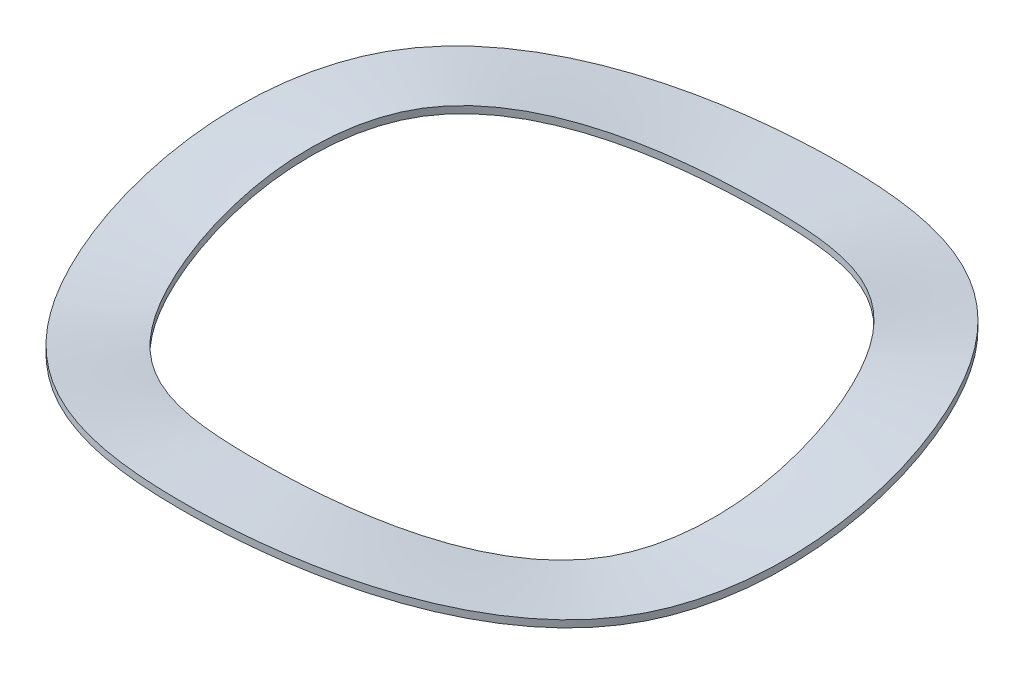
ISO-10303-21;
HEADER;
FILE_DESCRIPTION(('STEP AP214'),'2;1');
FILE_NAME('part.step','',(''),(''),'','','');
FILE_SCHEMA(('AUTOMOTIVE_DESIGN { 1 0 10303 214 1 1 1 1 }'));
ENDSEC;
DATA;
#1=APPLICATION_CONTEXT('core data for automotive mechanical design processes');
#2=APPLICATION_PROTOCOL_DEFINITION('international standard','automotive_design',2000,#1);
#3=PRODUCT_CONTEXT('',#1,'mechanical');
#4=PRODUCT('Part','Part','',(#3));
#5=PRODUCT_RELATED_PRODUCT_CATEGORY('part','',(#4));
#6=PRODUCT_DEFINITION_FORMATION('','',#4);
#7=PRODUCT_DEFINITION_CONTEXT('part definition',#1,'design');
#8=PRODUCT_DEFINITION('design','',#6,#7);
#9=PRODUCT_DEFINITION_SHAPE('','',#8);
#10=(LENGTH_UNIT() NAMED_UNIT(*) SI_UNIT(.MILLI.,.METRE.));
#11=(NAMED_UNIT(*) PLANE_ANGLE_UNIT() SI_UNIT($,.RADIAN.));
#12=(NAMED_UNIT(*) SI_UNIT($,.STERADIAN.) SOLID_ANGLE_UNIT());
#13=UNCERTAINTY_MEASURE_WITH_UNIT(LENGTH_MEASURE(1.E-05),#10,'distance_accuracy_value','');
#14=(GEOMETRIC_REPRESENTATION_CONTEXT(3) GLOBAL_UNCERTAINTY_ASSIGNED_CONTEXT((#13)) GLOBAL_UNIT_ASSIGNED_CONTEXT((#10,
#11,#12)) REPRESENTATION_CONTEXT('',''));
#15=CARTESIAN_POINT('',(0.,0.,0.));
#16=DIRECTION('',(0.,0.,1.));
#17=DIRECTION('',(1.,0.,0.));
#18=AXIS2_PLACEMENT_3D('',#15,#16,#17);
#19=CARTESIAN_POINT('',(0.,0.,-10.6553));
#20=CARTESIAN_POINT('',(3.69110419397773,0.,-10.6553));
#21=CARTESIAN_POINT('',(11.0733125819332,3.1242,-6.39318));
#22=CARTESIAN_POINT('',(11.0733125819332,-1.5621,6.39318000000003));
#23=CARTESIAN_POINT('',(0.,3.12419999999999,12.78636));
#24=CARTESIAN_POINT('',(-11.0733125819332,-1.5621,6.39317999999996));
#25=CARTESIAN_POINT('',(-11.0733125819332,1.5621,-2.13106000000005));
#26=CARTESIAN_POINT('',(-7.38220838795543,1.5621,-8.52424000000004));
#27=CARTESIAN_POINT('',(-3.69110419397772,0.,-10.6553));
#28=CARTESIAN_POINT('',(0.,0.,-10.6553));
#29=CARTESIAN_POINT('',(0.,0.,-11.6755333333333));
#30=CARTESIAN_POINT('',(4.04452338775946,0.,-11.6755333333333));
#31=CARTESIAN_POINT('',(12.1335701632784,3.1242,-7.00532));
#32=CARTESIAN_POINT('',(12.1335701632784,-1.5621,7.00532000000003));
#33=CARTESIAN_POINT('',(0.,3.1242,14.01064));
#34=CARTESIAN_POINT('',(-12.1335701632785,-1.5621,7.00531999999996));
#35=CARTESIAN_POINT('',(-12.1335701632784,1.5621,-2.33510666666672));
#36=CARTESIAN_POINT('',(-8.08904677551891,1.5621,-9.34042666666671));
#37=CARTESIAN_POINT('',(-4.04452338775946,0.,-11.6755333333333));
#38=CARTESIAN_POINT('',(0.,0.,-11.6755333333333));
#39=CARTESIAN_POINT('',(0.,0.,-12.6957666666667));
#40=CARTESIAN_POINT('',(4.3979425815412,0.,-12.6957666666667));
#41=CARTESIAN_POINT('',(13.1938277446236,3.1242,-7.61746));
#42=CARTESIAN_POINT('',(13.1938277446236,-1.5621,7.61746000000003));
#43=CARTESIAN_POINT('',(0.,3.1242,15.23492));
#44=CARTESIAN_POINT('',(-13.1938277446237,-1.5621,7.61745999999995));
#45=CARTESIAN_POINT('',(-13.1938277446236,1.5621,-2.53915333333339));
#46=CARTESIAN_POINT('',(-8.79588516308238,1.5621,-10.1566133333334));
#47=CARTESIAN_POINT('',(-4.3979425815412,0.,-12.6957666666667));
#48=CARTESIAN_POINT('',(0.,0.,-12.6957666666667));
#49=CARTESIAN_POINT('',(0.,0.,-13.716));
#50=CARTESIAN_POINT('',(4.75136177532294,0.,-13.716));
#51=CARTESIAN_POINT('',(14.2540853259689,3.1242,-8.2296));
#52=CARTESIAN_POINT('',(14.2540853259688,-1.5621,8.22960000000003));
#53=CARTESIAN_POINT('',(0.,3.1242,16.4592));
#54=CARTESIAN_POINT('',(-14.2540853259689,-1.5621,8.22959999999994));
#55=CARTESIAN_POINT('',(-14.2540853259688,1.5621,-2.74320000000006));
#56=CARTESIAN_POINT('',(-9.50272355064585,1.5621,-10.9728));
#57=CARTESIAN_POINT('',(-4.75136177532293,0.,-13.716));
#58=CARTESIAN_POINT('',(0.,0.,-13.716));
#59=B_SPLINE_SURFACE_WITH_KNOTS('',3,3,((#19,#20,#21,#22,#23,#24,#25,#26,#27,#28),(#29,#30,#31,
#32,#33,#34,#35,#36,#37,#38),(#39,#40,#41,#42,#43,#44,#45,#46,#47,#48),(#49,#50,#51,#52,#53,#54,
#55,#56,#57,#58)),.UNSPECIFIED.,.F.,.T.,.F.,(4,4),(4,1,1,1,1,2,4),(0.,1.),(0.,0.166666666666667,
0.333333333333334,0.5,0.666666666666666,0.833333333333333,1.),.UNSPECIFIED.);
#60=CARTESIAN_POINT('',(0.,0.,-13.716));
#61=CARTESIAN_POINT('',(4.75136177532294,0.,-13.716));
#62=CARTESIAN_POINT('',(14.2540853259689,3.1242,-8.2296));
#63=CARTESIAN_POINT('',(14.2540853259688,-1.5621,8.22960000000003));
#64=CARTESIAN_POINT('',(0.,3.1242,16.4592));
#65=CARTESIAN_POINT('',(-14.2540853259689,-1.5621,8.22959999999994));
#66=CARTESIAN_POINT('',(-14.2540853259688,1.5621,-2.74320000000006));
#67=CARTESIAN_POINT('',(-9.50272355064585,1.5621,-10.9728));
#68=CARTESIAN_POINT('',(-4.75136177532293,0.,-13.716));
#69=CARTESIAN_POINT('',(0.,0.,-13.716));
#70=B_SPLINE_CURVE_WITH_KNOTS('',3,(#60,#61,#62,#63,#64,#65,#66,#67,#68,#69),.UNSPECIFIED.,.T.,
.F.,(4,1,1,1,1,2,4),(0.,0.166666666666667,0.333333333333334,0.5,0.666666666666666,
0.833333333333333,1.),.UNSPECIFIED.);
#71=CARTESIAN_POINT('',(0.,0.,-13.716));
#72=VERTEX_POINT('',#71);
#73=EDGE_CURVE('E20',#72,#72,#70,.F.);
#74=CARTESIAN_POINT('',(0.,0.,-10.6553));
#75=CARTESIAN_POINT('',(3.69110419397773,0.,-10.6553));
#76=CARTESIAN_POINT('',(11.0733125819332,3.1242,-6.39318));
#77=CARTESIAN_POINT('',(11.0733125819332,-1.5621,6.39318000000003));
#78=CARTESIAN_POINT('',(0.,3.12419999999999,12.78636));
#79=CARTESIAN_POINT('',(-11.0733125819332,-1.5621,6.39317999999996));
#80=CARTESIAN_POINT('',(-11.0733125819332,1.5621,-2.13106000000005));
#81=CARTESIAN_POINT('',(-7.38220838795543,1.5621,-8.52424000000004));
#82=CARTESIAN_POINT('',(-3.69110419397772,0.,-10.6553));
#83=CARTESIAN_POINT('',(0.,0.,-10.6553));
#84=B_SPLINE_CURVE_WITH_KNOTS('',3,(#74,#75,#76,#77,#78,#79,#80,#81,#82,#83),.UNSPECIFIED.,.T.,
.F.,(4,1,1,1,1,2,4),(0.,0.166666666666667,0.333333333333334,0.5,0.666666666666666,
0.833333333333333,1.),.UNSPECIFIED.);
#85=CARTESIAN_POINT('',(0.,0.,-10.6553));
#86=VERTEX_POINT('',#85);
#87=EDGE_CURVE('E31',#86,#86,#84,.T.);
#88=ORIENTED_EDGE('',*,*,#73,.F.);
#89=EDGE_LOOP('',(#88));
#90=FACE_BOUND('',#89,.T.);
#91=ORIENTED_EDGE('',*,*,#87,.F.);
#92=EDGE_LOOP('',(#91));
#93=FACE_BOUND('',#92,.T.);
#94=ADVANCED_FACE('F14',(#90,#93),#59,.T.);
#95=CARTESIAN_POINT('',(0.,0.,-13.716));
#96=CARTESIAN_POINT('',(4.75136177532294,0.,-13.716));
#97=CARTESIAN_POINT('',(14.2540853259689,3.1242,-8.2296));
#98=CARTESIAN_POINT('',(14.2540853259688,-1.5621,8.22960000000003));
#99=CARTESIAN_POINT('',(0.,3.1242,16.4592));
#100=CARTESIAN_POINT('',(-14.2540853259689,-1.5621,8.22959999999994));
#101=CARTESIAN_POINT('',(-14.2540853259688,1.5621,-2.74320000000006));
#102=CARTESIAN_POINT('',(-9.50272355064585,1.5621,-10.9728));
#103=CARTESIAN_POINT('',(-4.75136177532293,0.,-13.716));
#104=CARTESIAN_POINT('',(0.,0.,-13.716));
#105=CARTESIAN_POINT('',(0.,0.0973666666666665,-13.716));
#106=CARTESIAN_POINT('',(4.75136177532294,0.0973666666666662,-13.716));
#107=CARTESIAN_POINT('',(14.2540853259689,3.22156666666667,-8.2296));
#108=CARTESIAN_POINT('',(14.2540853259688,-1.46473333333333,8.22960000000003));
#109=CARTESIAN_POINT('',(0.,3.22156666666666,16.4592));
#110=CARTESIAN_POINT('',(-14.2540853259689,-1.46473333333333,8.22959999999994));
#111=CARTESIAN_POINT('',(-14.2540853259688,1.65946666666666,-2.74320000000006));
#112=CARTESIAN_POINT('',(-9.50272355064585,1.65946666666667,-10.9728));
#113=CARTESIAN_POINT('',(-4.75136177532293,0.0973666666666667,-13.716));
#114=CARTESIAN_POINT('',(0.,0.0973666666666665,-13.716));
#115=CARTESIAN_POINT('',(0.,0.194733333333333,-13.716));
#116=CARTESIAN_POINT('',(4.75136177532294,0.194733333333333,-13.716));
#117=CARTESIAN_POINT('',(14.2540853259689,3.31893333333333,-8.2296));
#118=CARTESIAN_POINT('',(14.2540853259688,-1.36736666666666,8.22960000000003));
#119=CARTESIAN_POINT('',(0.,3.31893333333333,16.4592));
#120=CARTESIAN_POINT('',(-14.2540853259689,-1.36736666666667,8.22959999999994));
#121=CARTESIAN_POINT('',(-14.2540853259688,1.75683333333333,-2.74320000000006));
#122=CARTESIAN_POINT('',(-9.50272355064585,1.75683333333334,-10.9728));
#123=CARTESIAN_POINT('',(-4.75136177532293,0.194733333333333,-13.716));
#124=CARTESIAN_POINT('',(0.,0.194733333333333,-13.716));
#125=CARTESIAN_POINT('',(0.,0.292099999999999,-13.716));
#126=CARTESIAN_POINT('',(4.75136177532294,0.292099999999999,-13.716));
#127=CARTESIAN_POINT('',(14.2540853259689,3.4163,-8.2296));
#128=CARTESIAN_POINT('',(14.2540853259688,-1.27,8.22960000000003));
#129=CARTESIAN_POINT('',(0.,3.4163,16.4592));
#130=CARTESIAN_POINT('',(-14.2540853259689,-1.27,8.22959999999994));
#131=CARTESIAN_POINT('',(-14.2540853259688,1.8542,-2.74320000000006));
#132=CARTESIAN_POINT('',(-9.50272355064585,1.8542,-10.9728));
#133=CARTESIAN_POINT('',(-4.75136177532293,0.2921,-13.716));
#134=CARTESIAN_POINT('',(0.,0.292099999999999,-13.716));
#135=B_SPLINE_SURFACE_WITH_KNOTS('',3,3,((#95,#96,#97,#98,#99,#100,#101,#102,#103,#104),(#105,
#106,#107,#108,#109,#110,#111,#112,#113,#114),(#115,#116,#117,#118,#119,#120,#121,#122,#123,
#124),(#125,#126,#127,#128,#129,#130,#131,#132,#133,#134)),.UNSPECIFIED.,.F.,.T.,.F.,(4,4),(4,1,
1,1,1,2,4),(0.,1.),(0.,0.166666666666667,0.333333333333334,0.5,0.666666666666666,
0.833333333333333,1.),.UNSPECIFIED.);
#136=CARTESIAN_POINT('',(0.,0.292099999999999,-13.716));
#137=CARTESIAN_POINT('',(4.75136177532294,0.292099999999999,-13.716));
#138=CARTESIAN_POINT('',(14.2540853259689,3.4163,-8.2296));
#139=CARTESIAN_POINT('',(14.2540853259688,-1.27,8.22960000000003));
#140=CARTESIAN_POINT('',(0.,3.4163,16.4592));
#141=CARTESIAN_POINT('',(-14.2540853259689,-1.27,8.22959999999994));
#142=CARTESIAN_POINT('',(-14.2540853259688,1.8542,-2.74320000000006));
#143=CARTESIAN_POINT('',(-9.50272355064585,1.8542,-10.9728));
#144=CARTESIAN_POINT('',(-4.75136177532293,0.2921,-13.716));
#145=CARTESIAN_POINT('',(0.,0.292099999999999,-13.716));
#146=B_SPLINE_CURVE_WITH_KNOTS('',3,(#136,#137,#138,#139,#140,#141,#142,#143,#144,#145),
.UNSPECIFIED.,.T.,.F.,(4,1,1,1,1,2,4),(0.,0.166666666666667,0.333333333333334,0.5,
0.666666666666666,0.833333333333333,1.),.UNSPECIFIED.);
#147=CARTESIAN_POINT('',(0.,0.292099999999999,-13.716));
#148=VERTEX_POINT('',#147);
#149=EDGE_CURVE('E26',#148,#148,#146,.F.);
#150=ORIENTED_EDGE('',*,*,#149,.F.);
#151=EDGE_LOOP('',(#150));
#152=FACE_BOUND('',#151,.T.);
#153=ORIENTED_EDGE('',*,*,#73,.T.);
#154=EDGE_LOOP('',(#153));
#155=FACE_BOUND('',#154,.T.);
#156=ADVANCED_FACE('F54',(#152,#155),#135,.T.);
#157=CARTESIAN_POINT('',(0.,0.292099999999999,-10.6553));
#158=CARTESIAN_POINT('',(3.69110419397773,0.292099999999999,-10.6553));
#159=CARTESIAN_POINT('',(11.0733125819332,3.4163,-6.39318));
#160=CARTESIAN_POINT('',(11.0733125819332,-1.27,6.39318000000003));
#161=CARTESIAN_POINT('',(0.,3.4163,12.78636));
#162=CARTESIAN_POINT('',(-11.0733125819332,-1.27000000000001,6.39317999999996));
#163=CARTESIAN_POINT('',(-11.0733125819332,1.8542,-2.13106000000005));
#164=CARTESIAN_POINT('',(-7.38220838795543,1.8542,-8.52424000000004));
#165=CARTESIAN_POINT('',(-3.69110419397772,0.2921,-10.6553));
#166=CARTESIAN_POINT('',(0.,0.292099999999999,-10.6553));
#167=CARTESIAN_POINT('',(0.,0.194733333333333,-10.6553));
#168=CARTESIAN_POINT('',(3.69110419397773,0.194733333333332,-10.6553));
#169=CARTESIAN_POINT('',(11.0733125819332,3.31893333333334,-6.39318));
#170=CARTESIAN_POINT('',(11.0733125819332,-1.36736666666667,6.39318000000003));
#171=CARTESIAN_POINT('',(0.,3.31893333333333,12.78636));
#172=CARTESIAN_POINT('',(-11.0733125819332,-1.36736666666667,6.39317999999996));
#173=CARTESIAN_POINT('',(-11.0733125819332,1.75683333333333,-2.13106000000005));
#174=CARTESIAN_POINT('',(-7.38220838795543,1.75683333333334,-8.52424000000004));
#175=CARTESIAN_POINT('',(-3.69110419397772,0.194733333333333,-10.6553));
#176=CARTESIAN_POINT('',(0.,0.194733333333333,-10.6553));
#177=CARTESIAN_POINT('',(0.,0.0973666666666658,-10.6553));
#178=CARTESIAN_POINT('',(3.69110419397773,0.0973666666666655,-10.6553));
#179=CARTESIAN_POINT('',(11.0733125819332,3.22156666666667,-6.39318));
#180=CARTESIAN_POINT('',(11.0733125819332,-1.46473333333333,6.39318000000003));
#181=CARTESIAN_POINT('',(0.,3.22156666666666,12.78636));
#182=CARTESIAN_POINT('',(-11.0733125819332,-1.46473333333333,6.39317999999996));
#183=CARTESIAN_POINT('',(-11.0733125819332,1.65946666666666,-2.13106000000005));
#184=CARTESIAN_POINT('',(-7.38220838795543,1.65946666666667,-8.52424000000004));
#185=CARTESIAN_POINT('',(-3.69110419397772,0.0973666666666661,-10.6553));
#186=CARTESIAN_POINT('',(0.,0.0973666666666658,-10.6553));
#187=CARTESIAN_POINT('',(0.,0.,-10.6553));
#188=CARTESIAN_POINT('',(3.69110419397773,0.,-10.6553));
#189=CARTESIAN_POINT('',(11.0733125819332,3.1242,-6.39318));
#190=CARTESIAN_POINT('',(11.0733125819332,-1.5621,6.39318000000003));
#191=CARTESIAN_POINT('',(0.,3.12419999999999,12.78636));
#192=CARTESIAN_POINT('',(-11.0733125819332,-1.5621,6.39317999999996));
#193=CARTESIAN_POINT('',(-11.0733125819332,1.5621,-2.13106000000005));
#194=CARTESIAN_POINT('',(-7.38220838795543,1.5621,-8.52424000000004));
#195=CARTESIAN_POINT('',(-3.69110419397772,0.,-10.6553));
#196=CARTESIAN_POINT('',(0.,0.,-10.6553));
#197=B_SPLINE_SURFACE_WITH_KNOTS('',3,3,((#157,#158,#159,#160,#161,#162,#163,#164,#165,#166),
(#167,#168,#169,#170,#171,#172,#173,#174,#175,#176),(#177,#178,#179,#180,#181,#182,#183,#184,
#185,#186),(#187,#188,#189,#190,#191,#192,#193,#194,#195,#196)),.UNSPECIFIED.,.F.,.T.,.F.,(4,4),
(4,1,1,1,1,2,4),(0.,1.),(0.,0.166666666666667,0.333333333333334,0.5,0.666666666666666,
0.833333333333333,1.),.UNSPECIFIED.);
#198=CARTESIAN_POINT('',(0.,0.292099999999999,-10.6553));
#199=CARTESIAN_POINT('',(3.69110419397773,0.292099999999999,-10.6553));
#200=CARTESIAN_POINT('',(11.0733125819332,3.4163,-6.39318));
#201=CARTESIAN_POINT('',(11.0733125819332,-1.27,6.39318000000003));
#202=CARTESIAN_POINT('',(0.,3.4163,12.78636));
#203=CARTESIAN_POINT('',(-11.0733125819332,-1.27000000000001,6.39317999999997));
#204=CARTESIAN_POINT('',(-11.0733125819332,1.8542,-2.13106000000005));
#205=CARTESIAN_POINT('',(-7.38220838795543,1.8542,-8.52424000000004));
#206=CARTESIAN_POINT('',(-3.69110419397772,0.2921,-10.6553));
#207=CARTESIAN_POINT('',(0.,0.292099999999999,-10.6553));
#208=B_SPLINE_CURVE_WITH_KNOTS('',3,(#198,#199,#200,#201,#202,#203,#204,#205,#206,#207),
.UNSPECIFIED.,.T.,.F.,(4,1,1,1,1,2,4),(0.,0.166666666666667,0.333333333333334,0.5,
0.666666666666666,0.833333333333333,1.),.UNSPECIFIED.);
#209=CARTESIAN_POINT('',(0.,0.292099999999999,-10.6553));
#210=VERTEX_POINT('',#209);
#211=EDGE_CURVE('E10',#210,#210,#208,.T.);
#212=ORIENTED_EDGE('',*,*,#87,.T.);
#213=EDGE_LOOP('',(#212));
#214=FACE_BOUND('',#213,.T.);
#215=ORIENTED_EDGE('',*,*,#211,.F.);
#216=EDGE_LOOP('',(#215));
#217=FACE_BOUND('',#216,.T.);
#218=ADVANCED_FACE('F63',(#214,#217),#197,.T.);
#219=CARTESIAN_POINT('',(0.,0.292099999999999,-13.716));
#220=CARTESIAN_POINT('',(4.75136177532294,0.292099999999999,-13.716));
#221=CARTESIAN_POINT('',(14.2540853259689,3.4163,-8.2296));
#222=CARTESIAN_POINT('',(14.2540853259688,-1.27,8.22960000000003));
#223=CARTESIAN_POINT('',(0.,3.4163,16.4592));
#224=CARTESIAN_POINT('',(-14.2540853259689,-1.27,8.22959999999994));
#225=CARTESIAN_POINT('',(-14.2540853259688,1.8542,-2.74320000000006));
#226=CARTESIAN_POINT('',(-9.50272355064585,1.8542,-10.9728));
#227=CARTESIAN_POINT('',(-4.75136177532293,0.2921,-13.716));
#228=CARTESIAN_POINT('',(0.,0.292099999999999,-13.716));
#229=CARTESIAN_POINT('',(0.,0.292099999999999,-12.6957666666667));
#230=CARTESIAN_POINT('',(4.3979425815412,0.292099999999999,-12.6957666666667));
#231=CARTESIAN_POINT('',(13.1938277446236,3.4163,-7.61746));
#232=CARTESIAN_POINT('',(13.1938277446236,-1.27,7.61746000000003));
#233=CARTESIAN_POINT('',(0.,3.4163,15.23492));
#234=CARTESIAN_POINT('',(-13.1938277446237,-1.27,7.61745999999995));
#235=CARTESIAN_POINT('',(-13.1938277446236,1.8542,-2.53915333333339));
#236=CARTESIAN_POINT('',(-8.79588516308238,1.8542,-10.1566133333334));
#237=CARTESIAN_POINT('',(-4.3979425815412,0.2921,-12.6957666666667));
#238=CARTESIAN_POINT('',(0.,0.292099999999999,-12.6957666666667));
#239=CARTESIAN_POINT('',(0.,0.292099999999999,-11.6755333333333));
#240=CARTESIAN_POINT('',(4.04452338775947,0.292099999999998,-11.6755333333333));
#241=CARTESIAN_POINT('',(12.1335701632784,3.4163,-7.00532));
#242=CARTESIAN_POINT('',(12.1335701632784,-1.27,7.00532000000003));
#243=CARTESIAN_POINT('',(0.,3.4163,14.01064));
#244=CARTESIAN_POINT('',(-12.1335701632785,-1.27000000000001,7.00531999999996));
#245=CARTESIAN_POINT('',(-12.1335701632784,1.8542,-2.33510666666672));
#246=CARTESIAN_POINT('',(-8.08904677551891,1.8542,-9.34042666666671));
#247=CARTESIAN_POINT('',(-4.04452338775946,0.2921,-11.6755333333333));
#248=CARTESIAN_POINT('',(0.,0.292099999999999,-11.6755333333333));
#249=CARTESIAN_POINT('',(0.,0.292099999999999,-10.6553));
#250=CARTESIAN_POINT('',(3.69110419397773,0.292099999999999,-10.6553));
#251=CARTESIAN_POINT('',(11.0733125819332,3.4163,-6.39318));
#252=CARTESIAN_POINT('',(11.0733125819332,-1.27,6.39318000000003));
#253=CARTESIAN_POINT('',(0.,3.4163,12.78636));
#254=CARTESIAN_POINT('',(-11.0733125819332,-1.27000000000001,6.39317999999997));
#255=CARTESIAN_POINT('',(-11.0733125819332,1.8542,-2.13106000000005));
#256=CARTESIAN_POINT('',(-7.38220838795543,1.8542,-8.52424000000004));
#257=CARTESIAN_POINT('',(-3.69110419397772,0.2921,-10.6553));
#258=CARTESIAN_POINT('',(0.,0.292099999999999,-10.6553));
#259=B_SPLINE_SURFACE_WITH_KNOTS('',3,3,((#219,#220,#221,#222,#223,#224,#225,#226,#227,#228),
(#229,#230,#231,#232,#233,#234,#235,#236,#237,#238),(#239,#240,#241,#242,#243,#244,#245,#246,
#247,#248),(#249,#250,#251,#252,#253,#254,#255,#256,#257,#258)),.UNSPECIFIED.,.F.,.T.,.F.,(4,4),
(4,1,1,1,1,2,4),(0.,1.),(0.,0.166666666666667,0.333333333333334,0.5,0.666666666666666,
0.833333333333333,1.),.UNSPECIFIED.);
#260=ORIENTED_EDGE('',*,*,#211,.T.);
#261=EDGE_LOOP('',(#260));
#262=FACE_BOUND('',#261,.T.);
#263=ORIENTED_EDGE('',*,*,#149,.T.);
#264=EDGE_LOOP('',(#263));
#265=FACE_BOUND('',#264,.T.);
#266=ADVANCED_FACE('F16',(#262,#265),#259,.T.);
#267=CLOSED_SHELL('',(#94,#156,#218,#266));
#268=MANIFOLD_SOLID_BREP('B1',#267);
#269=ADVANCED_BREP_SHAPE_REPRESENTATION('',(#18,#268),#14);
#270=SHAPE_DEFINITION_REPRESENTATION(#9,#269);
ENDSEC;
END-ISO-10303-21;
